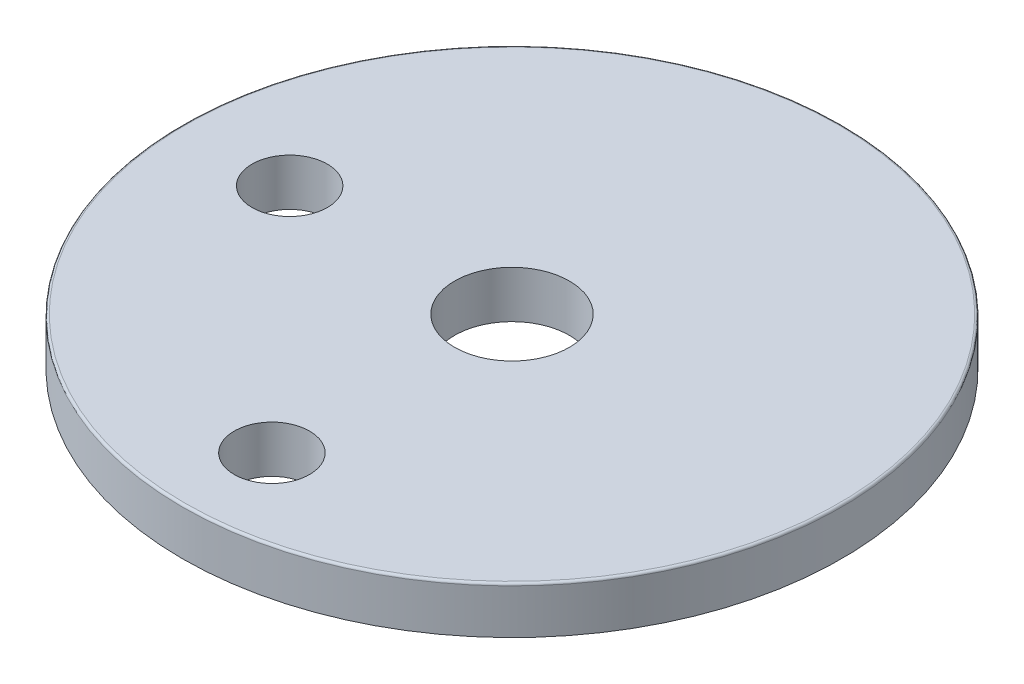
ISO-10303-21;
HEADER;
FILE_DESCRIPTION(('STEP AP214'),'2;1');
FILE_NAME('part.step','',(''),(''),'','','');
FILE_SCHEMA(('AUTOMOTIVE_DESIGN { 1 0 10303 214 1 1 1 1 }'));
ENDSEC;
DATA;
#1=APPLICATION_CONTEXT('core data for automotive mechanical design processes');
#2=APPLICATION_PROTOCOL_DEFINITION('international standard','automotive_design',2000,#1);
#3=PRODUCT_CONTEXT('',#1,'mechanical');
#4=PRODUCT('Part','Part','',(#3));
#5=PRODUCT_RELATED_PRODUCT_CATEGORY('part','',(#4));
#6=PRODUCT_DEFINITION_FORMATION('','',#4);
#7=PRODUCT_DEFINITION_CONTEXT('part definition',#1,'design');
#8=PRODUCT_DEFINITION('design','',#6,#7);
#9=PRODUCT_DEFINITION_SHAPE('','',#8);
#10=(LENGTH_UNIT() NAMED_UNIT(*) SI_UNIT(.MILLI.,.METRE.));
#11=(NAMED_UNIT(*) PLANE_ANGLE_UNIT() SI_UNIT($,.RADIAN.));
#12=(NAMED_UNIT(*) SI_UNIT($,.STERADIAN.) SOLID_ANGLE_UNIT());
#13=UNCERTAINTY_MEASURE_WITH_UNIT(LENGTH_MEASURE(1.E-05),#10,'distance_accuracy_value','');
#14=(GEOMETRIC_REPRESENTATION_CONTEXT(3) GLOBAL_UNCERTAINTY_ASSIGNED_CONTEXT((#13)) GLOBAL_UNIT_ASSIGNED_CONTEXT((#10,
#11,#12)) REPRESENTATION_CONTEXT('',''));
#15=CARTESIAN_POINT('',(0.,0.,0.));
#16=DIRECTION('',(0.,0.,1.));
#17=DIRECTION('',(1.,0.,0.));
#18=AXIS2_PLACEMENT_3D('',#15,#16,#17);
#19=CARTESIAN_POINT('',(0.,5.,0.));
#20=DIRECTION('',(0.,1.,0.));
#21=DIRECTION('',(0.,0.,1.));
#22=AXIS2_PLACEMENT_3D('',#19,#20,#21);
#23=PLANE('',#22);
#24=CARTESIAN_POINT('',(0.,5.,0.));
#25=DIRECTION('',(0.,1.,0.));
#26=DIRECTION('',(0.,0.,1.));
#27=AXIS2_PLACEMENT_3D('',#24,#25,#26);
#28=CIRCLE('',#27,34.75);
#29=CARTESIAN_POINT('',(0.,5.,34.75));
#30=VERTEX_POINT('',#29);
#31=EDGE_CURVE('E45',#30,#30,#28,.T.);
#32=ORIENTED_EDGE('',*,*,#31,.T.);
#33=EDGE_LOOP('',(#32));
#34=FACE_BOUND('',#33,.T.);
#35=CARTESIAN_POINT('',(-23.61,5.,0.));
#36=DIRECTION('',(0.,1.,0.));
#37=DIRECTION('',(0.,0.,1.));
#38=AXIS2_PLACEMENT_3D('',#35,#36,#37);
#39=CIRCLE('',#38,4.);
#40=CARTESIAN_POINT('',(-23.61,5.,4.));
#41=VERTEX_POINT('',#40);
#42=EDGE_CURVE('E62',#41,#41,#39,.T.);
#43=ORIENTED_EDGE('',*,*,#42,.F.);
#44=EDGE_LOOP('',(#43));
#45=FACE_BOUND('',#44,.T.);
#46=CARTESIAN_POINT('',(0.,5.,0.));
#47=DIRECTION('',(0.,1.,0.));
#48=DIRECTION('',(0.,0.,1.));
#49=AXIS2_PLACEMENT_3D('',#46,#47,#48);
#50=CIRCLE('',#49,6.1);
#51=CARTESIAN_POINT('',(0.,5.,6.1));
#52=VERTEX_POINT('',#51);
#53=EDGE_CURVE('E55',#52,#52,#50,.T.);
#54=ORIENTED_EDGE('',*,*,#53,.F.);
#55=EDGE_LOOP('',(#54));
#56=FACE_BOUND('',#55,.T.);
#57=CARTESIAN_POINT('',(0.,5.,25.5));
#58=DIRECTION('',(0.,1.,0.));
#59=DIRECTION('',(0.,0.,1.));
#60=AXIS2_PLACEMENT_3D('',#57,#58,#59);
#61=CIRCLE('',#60,4.);
#62=CARTESIAN_POINT('',(0.,5.,29.5));
#63=VERTEX_POINT('',#62);
#64=EDGE_CURVE('E70',#63,#63,#61,.T.);
#65=ORIENTED_EDGE('',*,*,#64,.F.);
#66=EDGE_LOOP('',(#65));
#67=FACE_BOUND('',#66,.T.);
#68=ADVANCED_FACE('F37',(#34,#45,#56,#67),#23,.T.);
#69=CARTESIAN_POINT('',(0.,0.,0.));
#70=DIRECTION('',(0.,1.,0.));
#71=DIRECTION('',(0.,0.,1.));
#72=AXIS2_PLACEMENT_3D('',#69,#70,#71);
#73=PLANE('',#72);
#74=CARTESIAN_POINT('',(0.,0.,0.));
#75=DIRECTION('',(0.,1.,0.));
#76=DIRECTION('',(0.,0.,1.));
#77=AXIS2_PLACEMENT_3D('',#74,#75,#76);
#78=CIRCLE('',#77,35.);
#79=CARTESIAN_POINT('',(0.,0.,35.));
#80=VERTEX_POINT('',#79);
#81=EDGE_CURVE('E50',#80,#80,#78,.T.);
#82=ORIENTED_EDGE('',*,*,#81,.F.);
#83=EDGE_LOOP('',(#82));
#84=FACE_BOUND('',#83,.T.);
#85=CARTESIAN_POINT('',(0.,0.,0.));
#86=DIRECTION('',(0.,1.,0.));
#87=DIRECTION('',(0.,0.,1.));
#88=AXIS2_PLACEMENT_3D('',#85,#86,#87);
#89=CIRCLE('',#88,6.1);
#90=CARTESIAN_POINT('',(0.,0.,6.1));
#91=VERTEX_POINT('',#90);
#92=EDGE_CURVE('E58',#91,#91,#89,.T.);
#93=ORIENTED_EDGE('',*,*,#92,.T.);
#94=EDGE_LOOP('',(#93));
#95=FACE_BOUND('',#94,.T.);
#96=CARTESIAN_POINT('',(-23.61,0.,0.));
#97=DIRECTION('',(0.,1.,0.));
#98=DIRECTION('',(0.,0.,1.));
#99=AXIS2_PLACEMENT_3D('',#96,#97,#98);
#100=CIRCLE('',#99,4.);
#101=CARTESIAN_POINT('',(-23.61,0.,4.));
#102=VERTEX_POINT('',#101);
#103=EDGE_CURVE('E66',#102,#102,#100,.T.);
#104=ORIENTED_EDGE('',*,*,#103,.T.);
#105=EDGE_LOOP('',(#104));
#106=FACE_BOUND('',#105,.T.);
#107=CARTESIAN_POINT('',(0.,0.,25.5));
#108=DIRECTION('',(0.,1.,0.));
#109=DIRECTION('',(0.,0.,1.));
#110=AXIS2_PLACEMENT_3D('',#107,#108,#109);
#111=CIRCLE('',#110,4.);
#112=CARTESIAN_POINT('',(0.,0.,29.5));
#113=VERTEX_POINT('',#112);
#114=EDGE_CURVE('E74',#113,#113,#111,.T.);
#115=ORIENTED_EDGE('',*,*,#114,.T.);
#116=EDGE_LOOP('',(#115));
#117=FACE_BOUND('',#116,.T.);
#118=ADVANCED_FACE('F86',(#84,#95,#106,#117),#73,.F.);
#119=CARTESIAN_POINT('',(0.,5.,0.));
#120=DIRECTION('',(0.,-1.,0.));
#121=DIRECTION('',(0.,0.,-1.));
#122=AXIS2_PLACEMENT_3D('',#119,#120,#121);
#123=CYLINDRICAL_SURFACE('',#122,35.);
#124=CARTESIAN_POINT('',(0.,4.75,0.));
#125=DIRECTION('',(0.,1.,0.));
#126=DIRECTION('',(0.,0.,1.));
#127=AXIS2_PLACEMENT_3D('',#124,#125,#126);
#128=CIRCLE('',#127,35.);
#129=CARTESIAN_POINT('',(0.,4.75,35.));
#130=VERTEX_POINT('',#129);
#131=EDGE_CURVE('E10',#130,#130,#128,.F.);
#132=ORIENTED_EDGE('',*,*,#131,.T.);
#133=EDGE_LOOP('',(#132));
#134=FACE_BOUND('',#133,.T.);
#135=ORIENTED_EDGE('',*,*,#81,.T.);
#136=EDGE_LOOP('',(#135));
#137=FACE_BOUND('',#136,.T.);
#138=ADVANCED_FACE('F91',(#134,#137),#123,.T.);
#139=CARTESIAN_POINT('',(0.,5.,0.));
#140=DIRECTION('',(0.,-1.,0.));
#141=DIRECTION('',(0.,0.,-1.));
#142=AXIS2_PLACEMENT_3D('',#139,#140,#141);
#143=CYLINDRICAL_SURFACE('',#142,6.1);
#144=ORIENTED_EDGE('',*,*,#53,.T.);
#145=EDGE_LOOP('',(#144));
#146=FACE_BOUND('',#145,.T.);
#147=ORIENTED_EDGE('',*,*,#92,.F.);
#148=EDGE_LOOP('',(#147));
#149=FACE_BOUND('',#148,.T.);
#150=ADVANCED_FACE('F96',(#146,#149),#143,.F.);
#151=CARTESIAN_POINT('',(-23.61,5.,0.));
#152=DIRECTION('',(0.,-1.,0.));
#153=DIRECTION('',(0.,0.,-1.));
#154=AXIS2_PLACEMENT_3D('',#151,#152,#153);
#155=CYLINDRICAL_SURFACE('',#154,4.);
#156=ORIENTED_EDGE('',*,*,#42,.T.);
#157=EDGE_LOOP('',(#156));
#158=FACE_BOUND('',#157,.T.);
#159=ORIENTED_EDGE('',*,*,#103,.F.);
#160=EDGE_LOOP('',(#159));
#161=FACE_BOUND('',#160,.T.);
#162=ADVANCED_FACE('F102',(#158,#161),#155,.F.);
#163=CARTESIAN_POINT('',(0.,5.,25.5));
#164=DIRECTION('',(0.,-1.,0.));
#165=DIRECTION('',(0.,0.,-1.));
#166=AXIS2_PLACEMENT_3D('',#163,#164,#165);
#167=CYLINDRICAL_SURFACE('',#166,4.);
#168=ORIENTED_EDGE('',*,*,#64,.T.);
#169=EDGE_LOOP('',(#168));
#170=FACE_BOUND('',#169,.T.);
#171=ORIENTED_EDGE('',*,*,#114,.F.);
#172=EDGE_LOOP('',(#171));
#173=FACE_BOUND('',#172,.T.);
#174=ADVANCED_FACE('F82',(#170,#173),#167,.F.);
#175=CARTESIAN_POINT('',(0.,4.75,0.));
#176=DIRECTION('',(0.,1.,0.));
#177=DIRECTION('',(0.,0.,1.));
#178=AXIS2_PLACEMENT_3D('',#175,#176,#177);
#179=TOROIDAL_SURFACE('',#178,34.75,0.25);
#180=ORIENTED_EDGE('',*,*,#131,.F.);
#181=EDGE_LOOP('',(#180));
#182=FACE_BOUND('',#181,.T.);
#183=ORIENTED_EDGE('',*,*,#31,.F.);
#184=EDGE_LOOP('',(#183));
#185=FACE_BOUND('',#184,.T.);
#186=ADVANCED_FACE('F39',(#182,#185),#179,.T.);
#187=CLOSED_SHELL('',(#68,#118,#138,#150,#162,#174,#186));
#188=MANIFOLD_SOLID_BREP('B2',#187);
#189=ADVANCED_BREP_SHAPE_REPRESENTATION('',(#18,#188),#14);
#190=SHAPE_DEFINITION_REPRESENTATION(#9,#189);
ENDSEC;
END-ISO-10303-21;
